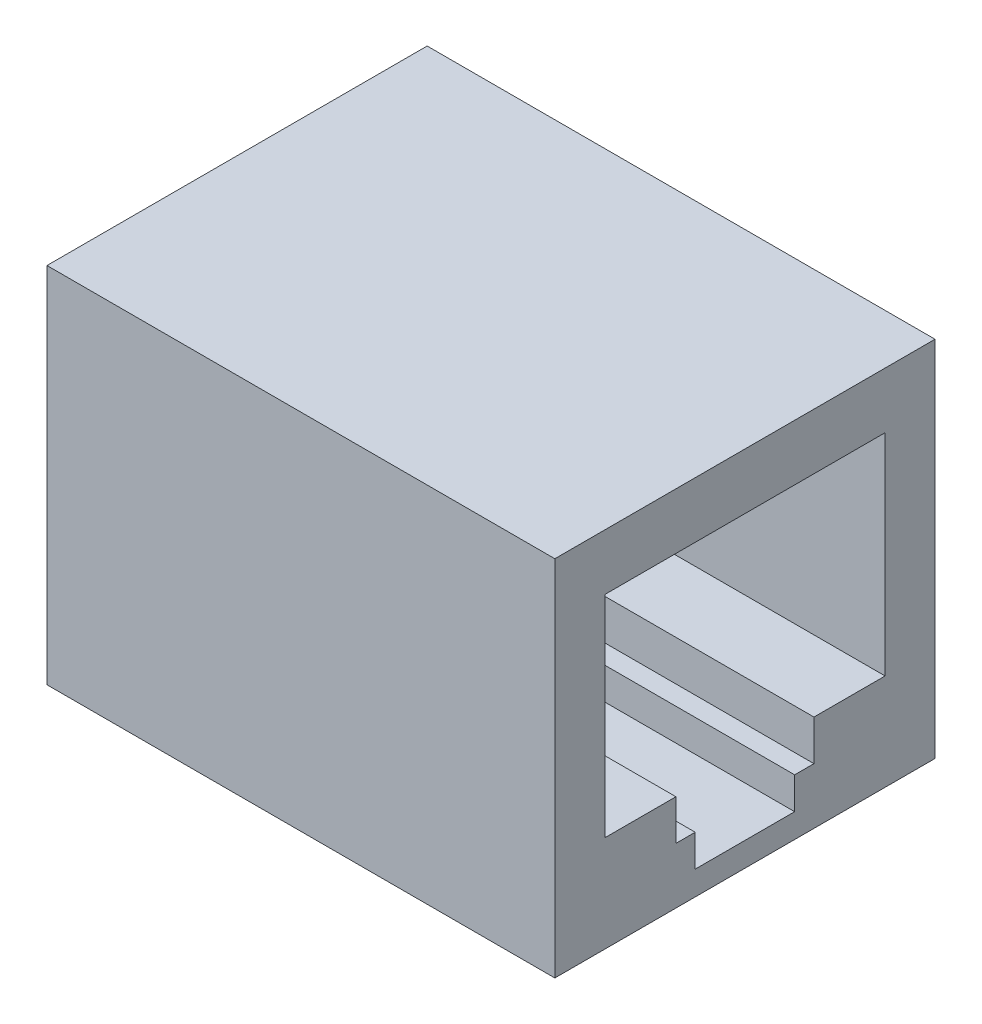
ISO-10303-21;
HEADER;
FILE_DESCRIPTION(('STEP AP214'),'2;1');
FILE_NAME('part.step','',(''),(''),'','','');
FILE_SCHEMA(('AUTOMOTIVE_DESIGN { 1 0 10303 214 1 1 1 1 }'));
ENDSEC;
DATA;
#1=APPLICATION_CONTEXT('core data for automotive mechanical design processes');
#2=APPLICATION_PROTOCOL_DEFINITION('international standard','automotive_design',2000,#1);
#3=PRODUCT_CONTEXT('',#1,'mechanical');
#4=PRODUCT('Part','Part','',(#3));
#5=PRODUCT_RELATED_PRODUCT_CATEGORY('part','',(#4));
#6=PRODUCT_DEFINITION_FORMATION('','',#4);
#7=PRODUCT_DEFINITION_CONTEXT('part definition',#1,'design');
#8=PRODUCT_DEFINITION('design','',#6,#7);
#9=PRODUCT_DEFINITION_SHAPE('','',#8);
#10=(LENGTH_UNIT() NAMED_UNIT(*) SI_UNIT(.MILLI.,.METRE.));
#11=(NAMED_UNIT(*) PLANE_ANGLE_UNIT() SI_UNIT($,.RADIAN.));
#12=(NAMED_UNIT(*) SI_UNIT($,.STERADIAN.) SOLID_ANGLE_UNIT());
#13=UNCERTAINTY_MEASURE_WITH_UNIT(LENGTH_MEASURE(1.E-05),#10,'distance_accuracy_value','');
#14=(GEOMETRIC_REPRESENTATION_CONTEXT(3) GLOBAL_UNCERTAINTY_ASSIGNED_CONTEXT((#13)) GLOBAL_UNIT_ASSIGNED_CONTEXT((#10,
#11,#12)) REPRESENTATION_CONTEXT('',''));
#15=CARTESIAN_POINT('',(0.,0.,0.));
#16=DIRECTION('',(0.,0.,1.));
#17=DIRECTION('',(1.,0.,0.));
#18=AXIS2_PLACEMENT_3D('',#15,#16,#17);
#19=CARTESIAN_POINT('',(54.428765489023,-5.08779999900248,21.8945000000485));
#20=DIRECTION('',(0.,1.,0.));
#21=DIRECTION('',(1.,0.,0.));
#22=AXIS2_PLACEMENT_3D('',#19,#20,#21);
#23=PLANE('',#22);
#24=DIRECTION('',(0.,0.,-1.));
#25=VECTOR('',#24,1.);
#26=CARTESIAN_POINT('',(34.1938264547354,-5.08779999900248,21.8945000000485));
#27=LINE('',#26,#25);
#28=CARTESIAN_POINT('',(34.1938264547354,-5.08779999900248,21.8945000000485));
#29=VERTEX_POINT('',#28);
#30=CARTESIAN_POINT('',(34.1938264547354,-5.08779999900249,21.0817000000485));
#31=VERTEX_POINT('',#30);
#32=EDGE_CURVE('E41',#29,#31,#27,.T.);
#33=ORIENTED_EDGE('',*,*,#32,.F.);
#34=DIRECTION('',(1.,0.,0.));
#35=VECTOR('',#34,1.);
#36=CARTESIAN_POINT('',(34.1938264547354,-5.08779999900248,21.8945000000485));
#37=LINE('',#36,#35);
#38=CARTESIAN_POINT('',(46.3938264547354,-5.08779999900248,21.8945000000485));
#39=VERTEX_POINT('',#38);
#40=EDGE_CURVE('E11',#29,#39,#37,.T.);
#41=ORIENTED_EDGE('',*,*,#40,.T.);
#42=DIRECTION('',(0.,0.,-1.));
#43=VECTOR('',#42,1.);
#44=CARTESIAN_POINT('',(46.3938264547354,-5.08779999900248,21.8945000000485));
#45=LINE('',#44,#43);
#46=CARTESIAN_POINT('',(46.3938264547354,-5.08779999900249,21.0817000000485));
#47=VERTEX_POINT('',#46);
#48=EDGE_CURVE('E28',#39,#47,#45,.T.);
#49=ORIENTED_EDGE('',*,*,#48,.T.);
#50=DIRECTION('',(1.,0.,0.));
#51=VECTOR('',#50,1.);
#52=CARTESIAN_POINT('',(34.1938264547354,-5.08779999900249,21.0817000000485));
#53=LINE('',#52,#51);
#54=EDGE_CURVE('E247',#31,#47,#53,.T.);
#55=ORIENTED_EDGE('',*,*,#54,.F.);
#56=EDGE_LOOP('',(#33,#41,#49,#55));
#57=FACE_BOUND('',#56,.T.);
#58=ADVANCED_FACE('F17',(#57),#23,.T.);
#59=CARTESIAN_POINT('',(34.1938264547354,-20.6051200114452,23.9900000000484));
#60=DIRECTION('',(1.,0.,0.));
#61=DIRECTION('',(0.,1.,0.));
#62=AXIS2_PLACEMENT_3D('',#59,#60,#61);
#63=PLANE('',#62);
#64=ORIENTED_EDGE('',*,*,#32,.T.);
#65=DIRECTION('',(0.,1.,0.));
#66=VECTOR('',#65,1.);
#67=CARTESIAN_POINT('',(34.1938264547354,-5.08779999900249,21.0817000000485));
#68=LINE('',#67,#66);
#69=CARTESIAN_POINT('',(34.1938264547354,-3.38599999900249,21.0817000000485));
#70=VERTEX_POINT('',#69);
#71=EDGE_CURVE('E261',#31,#70,#68,.T.);
#72=ORIENTED_EDGE('',*,*,#71,.T.);
#73=DIRECTION('',(0.,0.,-1.));
#74=VECTOR('',#73,1.);
#75=CARTESIAN_POINT('',(34.1938264547354,-3.38599999900249,21.0817000000485));
#76=LINE('',#75,#74);
#77=CARTESIAN_POINT('',(34.1938264547354,-3.38599999900248,18.0845000000485));
#78=VERTEX_POINT('',#77);
#79=EDGE_CURVE('E211',#70,#78,#76,.T.);
#80=ORIENTED_EDGE('',*,*,#79,.T.);
#81=DIRECTION('',(0.,1.,0.));
#82=VECTOR('',#81,1.);
#83=CARTESIAN_POINT('',(34.1938264547354,-3.38599999900248,18.0845000000485));
#84=LINE('',#83,#82);
#85=CARTESIAN_POINT('',(34.1938264547354,5.49111945001675,18.0845000000485));
#86=VERTEX_POINT('',#85);
#87=EDGE_CURVE('E182',#78,#86,#84,.T.);
#88=ORIENTED_EDGE('',*,*,#87,.T.);
#89=DIRECTION('',(0.,0.,1.));
#90=VECTOR('',#89,1.);
#91=CARTESIAN_POINT('',(34.1938264547354,5.49111945001675,18.0845000000485));
#92=LINE('',#91,#90);
#93=CARTESIAN_POINT('',(34.1938264547354,5.49111945001675,29.8955000000484));
#94=VERTEX_POINT('',#93);
#95=EDGE_CURVE('E176',#86,#94,#92,.T.);
#96=ORIENTED_EDGE('',*,*,#95,.T.);
#97=DIRECTION('',(0.,-1.,0.));
#98=VECTOR('',#97,1.);
#99=CARTESIAN_POINT('',(34.1938264547354,5.49111945001675,29.8955000000484));
#100=LINE('',#99,#98);
#101=CARTESIAN_POINT('',(34.1938264547354,-3.38599999900248,29.8955000000485));
#102=VERTEX_POINT('',#101);
#103=EDGE_CURVE('E166',#94,#102,#100,.T.);
#104=ORIENTED_EDGE('',*,*,#103,.T.);
#105=DIRECTION('',(0.,0.,-1.));
#106=VECTOR('',#105,1.);
#107=CARTESIAN_POINT('',(34.1938264547354,-3.38599999900248,29.8955000000485));
#108=LINE('',#107,#106);
#109=CARTESIAN_POINT('',(34.1938264547354,-3.38599999900248,26.8983000000485));
#110=VERTEX_POINT('',#109);
#111=EDGE_CURVE('E158',#102,#110,#108,.T.);
#112=ORIENTED_EDGE('',*,*,#111,.T.);
#113=DIRECTION('',(0.,-1.,0.));
#114=VECTOR('',#113,1.);
#115=CARTESIAN_POINT('',(34.1938264547354,-3.38599999900248,26.8983000000485));
#116=LINE('',#115,#114);
#117=CARTESIAN_POINT('',(34.1938264547354,-5.08779999900248,26.8983000000485));
#118=VERTEX_POINT('',#117);
#119=EDGE_CURVE('E208',#110,#118,#116,.T.);
#120=ORIENTED_EDGE('',*,*,#119,.T.);
#121=DIRECTION('',(0.,0.,-1.));
#122=VECTOR('',#121,1.);
#123=CARTESIAN_POINT('',(34.1938264547354,-5.08779999900248,26.8983000000485));
#124=LINE('',#123,#122);
#125=CARTESIAN_POINT('',(34.1938264547354,-5.08779999900248,26.0855000000485));
#126=VERTEX_POINT('',#125);
#127=EDGE_CURVE('E259',#118,#126,#124,.T.);
#128=ORIENTED_EDGE('',*,*,#127,.T.);
#129=DIRECTION('',(0.,-1.,0.));
#130=VECTOR('',#129,1.);
#131=CARTESIAN_POINT('',(34.1938264547354,-5.08779999900248,26.0855000000485));
#132=LINE('',#131,#130);
#133=CARTESIAN_POINT('',(34.1938264547354,-6.43399999900248,26.0855000000484));
#134=VERTEX_POINT('',#133);
#135=EDGE_CURVE('E294',#126,#134,#132,.T.);
#136=ORIENTED_EDGE('',*,*,#135,.T.);
#137=DIRECTION('',(0.,0.,-1.));
#138=VECTOR('',#137,1.);
#139=CARTESIAN_POINT('',(34.1938264547354,-6.43399999900248,26.0855000000484));
#140=LINE('',#139,#138);
#141=CARTESIAN_POINT('',(34.1938264547354,-6.43399999900249,21.8945000000484));
#142=VERTEX_POINT('',#141);
#143=EDGE_CURVE('E290',#134,#142,#140,.T.);
#144=ORIENTED_EDGE('',*,*,#143,.T.);
#145=DIRECTION('',(0.,1.,0.));
#146=VECTOR('',#145,1.);
#147=CARTESIAN_POINT('',(34.1938264547354,-6.43399999900248,21.8945000000484));
#148=LINE('',#147,#146);
#149=EDGE_CURVE('E216',#142,#29,#148,.T.);
#150=ORIENTED_EDGE('',*,*,#149,.T.);
#151=EDGE_LOOP('',(#64,#72,#80,#88,#96,#104,#112,#120,#128,#136,#144,#150));
#152=FACE_BOUND('',#151,.T.);
#153=ADVANCED_FACE('F179',(#152),#63,.T.);
#154=CARTESIAN_POINT('',(54.428765489023,-6.43399999900248,26.0855000000485));
#155=DIRECTION('',(0.,1.,0.));
#156=DIRECTION('',(1.,0.,0.));
#157=AXIS2_PLACEMENT_3D('',#154,#155,#156);
#158=PLANE('',#157);
#159=ORIENTED_EDGE('',*,*,#143,.F.);
#160=DIRECTION('',(1.,0.,0.));
#161=VECTOR('',#160,1.);
#162=CARTESIAN_POINT('',(34.1938264547354,-6.43399999900248,26.0855000000484));
#163=LINE('',#162,#161);
#164=CARTESIAN_POINT('',(46.3938264547354,-6.43399999900248,26.0855000000484));
#165=VERTEX_POINT('',#164);
#166=EDGE_CURVE('E212',#134,#165,#163,.T.);
#167=ORIENTED_EDGE('',*,*,#166,.T.);
#168=DIRECTION('',(0.,0.,-1.));
#169=VECTOR('',#168,1.);
#170=CARTESIAN_POINT('',(46.3938264547354,-6.43399999900248,26.0855000000484));
#171=LINE('',#170,#169);
#172=CARTESIAN_POINT('',(46.3938264547354,-6.43399999900249,21.8945000000485));
#173=VERTEX_POINT('',#172);
#174=EDGE_CURVE('E204',#165,#173,#171,.T.);
#175=ORIENTED_EDGE('',*,*,#174,.T.);
#176=DIRECTION('',(1.,0.,0.));
#177=VECTOR('',#176,1.);
#178=CARTESIAN_POINT('',(34.1938264547354,-6.43399999900248,21.8945000000484));
#179=LINE('',#178,#177);
#180=EDGE_CURVE('E298',#142,#173,#179,.T.);
#181=ORIENTED_EDGE('',*,*,#180,.F.);
#182=EDGE_LOOP('',(#159,#167,#175,#181));
#183=FACE_BOUND('',#182,.T.);
#184=ADVANCED_FACE('F495',(#183),#158,.T.);
#185=CARTESIAN_POINT('',(54.428765489023,-5.08779999900248,26.0855000000485));
#186=DIRECTION('',(0.,0.,-1.));
#187=DIRECTION('',(-1.,0.,0.));
#188=AXIS2_PLACEMENT_3D('',#185,#186,#187);
#189=PLANE('',#188);
#190=ORIENTED_EDGE('',*,*,#135,.F.);
#191=DIRECTION('',(1.,0.,0.));
#192=VECTOR('',#191,1.);
#193=CARTESIAN_POINT('',(34.1938264547354,-5.08779999900248,26.0855000000485));
#194=LINE('',#193,#192);
#195=CARTESIAN_POINT('',(46.3938264547354,-5.08779999900248,26.0855000000485));
#196=VERTEX_POINT('',#195);
#197=EDGE_CURVE('E221',#126,#196,#194,.T.);
#198=ORIENTED_EDGE('',*,*,#197,.T.);
#199=DIRECTION('',(0.,-1.,0.));
#200=VECTOR('',#199,1.);
#201=CARTESIAN_POINT('',(46.3938264547354,-5.08779999900248,26.0855000000485));
#202=LINE('',#201,#200);
#203=EDGE_CURVE('E217',#196,#165,#202,.T.);
#204=ORIENTED_EDGE('',*,*,#203,.T.);
#205=ORIENTED_EDGE('',*,*,#166,.F.);
#206=EDGE_LOOP('',(#190,#198,#204,#205));
#207=FACE_BOUND('',#206,.T.);
#208=ADVANCED_FACE('F489',(#207),#189,.T.);
#209=CARTESIAN_POINT('',(54.428765489023,-5.08779999900248,26.8983000000485));
#210=DIRECTION('',(0.,1.,0.));
#211=DIRECTION('',(1.,0.,0.));
#212=AXIS2_PLACEMENT_3D('',#209,#210,#211);
#213=PLANE('',#212);
#214=ORIENTED_EDGE('',*,*,#127,.F.);
#215=DIRECTION('',(1.,0.,0.));
#216=VECTOR('',#215,1.);
#217=CARTESIAN_POINT('',(34.1938264547354,-5.08779999900248,26.8983000000485));
#218=LINE('',#217,#216);
#219=CARTESIAN_POINT('',(46.3938264547354,-5.08779999900248,26.8983000000485));
#220=VERTEX_POINT('',#219);
#221=EDGE_CURVE('E222',#118,#220,#218,.T.);
#222=ORIENTED_EDGE('',*,*,#221,.T.);
#223=DIRECTION('',(0.,0.,-1.));
#224=VECTOR('',#223,1.);
#225=CARTESIAN_POINT('',(46.3938264547354,-5.08779999900248,26.8983000000485));
#226=LINE('',#225,#224);
#227=EDGE_CURVE('E223',#220,#196,#226,.T.);
#228=ORIENTED_EDGE('',*,*,#227,.T.);
#229=ORIENTED_EDGE('',*,*,#197,.F.);
#230=EDGE_LOOP('',(#214,#222,#228,#229));
#231=FACE_BOUND('',#230,.T.);
#232=ADVANCED_FACE('F494',(#231),#213,.T.);
#233=CARTESIAN_POINT('',(54.428765489023,-3.38599999900248,26.8983000000485));
#234=DIRECTION('',(0.,0.,-1.));
#235=DIRECTION('',(0.,-1.,0.));
#236=AXIS2_PLACEMENT_3D('',#233,#234,#235);
#237=PLANE('',#236);
#238=ORIENTED_EDGE('',*,*,#119,.F.);
#239=DIRECTION('',(1.,0.,0.));
#240=VECTOR('',#239,1.);
#241=CARTESIAN_POINT('',(34.1938264547354,-3.38599999900248,26.8983000000485));
#242=LINE('',#241,#240);
#243=CARTESIAN_POINT('',(46.3938264547354,-3.38599999900248,26.8983000000485));
#244=VERTEX_POINT('',#243);
#245=EDGE_CURVE('E227',#110,#244,#242,.T.);
#246=ORIENTED_EDGE('',*,*,#245,.T.);
#247=DIRECTION('',(0.,-1.,0.));
#248=VECTOR('',#247,1.);
#249=CARTESIAN_POINT('',(46.3938264547354,-3.38599999900248,26.8983000000485));
#250=LINE('',#249,#248);
#251=EDGE_CURVE('E253',#244,#220,#250,.T.);
#252=ORIENTED_EDGE('',*,*,#251,.T.);
#253=ORIENTED_EDGE('',*,*,#221,.F.);
#254=EDGE_LOOP('',(#238,#246,#252,#253));
#255=FACE_BOUND('',#254,.T.);
#256=ADVANCED_FACE('F19',(#255),#237,.T.);
#257=CARTESIAN_POINT('',(54.428765489023,-3.38599999900248,29.8955000000485));
#258=DIRECTION('',(0.,1.,0.));
#259=DIRECTION('',(1.,0.,0.));
#260=AXIS2_PLACEMENT_3D('',#257,#258,#259);
#261=PLANE('',#260);
#262=ORIENTED_EDGE('',*,*,#111,.F.);
#263=DIRECTION('',(1.,0.,0.));
#264=VECTOR('',#263,1.);
#265=CARTESIAN_POINT('',(34.1938264547354,-3.38599999900248,29.8955000000485));
#266=LINE('',#265,#264);
#267=CARTESIAN_POINT('',(46.3938264547354,-3.38599999900248,29.8955000000485));
#268=VERTEX_POINT('',#267);
#269=EDGE_CURVE('E173',#102,#268,#266,.T.);
#270=ORIENTED_EDGE('',*,*,#269,.T.);
#271=DIRECTION('',(0.,0.,-1.));
#272=VECTOR('',#271,1.);
#273=CARTESIAN_POINT('',(46.3938264547354,-3.38599999900248,29.8955000000485));
#274=LINE('',#273,#272);
#275=EDGE_CURVE('E190',#268,#244,#274,.T.);
#276=ORIENTED_EDGE('',*,*,#275,.T.);
#277=ORIENTED_EDGE('',*,*,#245,.F.);
#278=EDGE_LOOP('',(#262,#270,#276,#277));
#279=FACE_BOUND('',#278,.T.);
#280=ADVANCED_FACE('F459',(#279),#261,.T.);
#281=CARTESIAN_POINT('',(54.428765489023,5.49111945001675,29.8955000000485));
#282=DIRECTION('',(0.,0.,-1.));
#283=DIRECTION('',(0.,-1.,0.));
#284=AXIS2_PLACEMENT_3D('',#281,#282,#283);
#285=PLANE('',#284);
#286=ORIENTED_EDGE('',*,*,#103,.F.);
#287=DIRECTION('',(1.,0.,0.));
#288=VECTOR('',#287,1.);
#289=CARTESIAN_POINT('',(34.1938264547354,5.49111945001675,29.8955000000484));
#290=LINE('',#289,#288);
#291=CARTESIAN_POINT('',(46.3938264547355,5.49111945001675,29.8955000000484));
#292=VERTEX_POINT('',#291);
#293=EDGE_CURVE('E171',#94,#292,#290,.T.);
#294=ORIENTED_EDGE('',*,*,#293,.T.);
#295=DIRECTION('',(0.,-1.,0.));
#296=VECTOR('',#295,1.);
#297=CARTESIAN_POINT('',(46.3938264547354,5.49111945001675,29.8955000000484));
#298=LINE('',#297,#296);
#299=EDGE_CURVE('E191',#292,#268,#298,.T.);
#300=ORIENTED_EDGE('',*,*,#299,.T.);
#301=ORIENTED_EDGE('',*,*,#269,.F.);
#302=EDGE_LOOP('',(#286,#294,#300,#301));
#303=FACE_BOUND('',#302,.T.);
#304=ADVANCED_FACE('F168',(#303),#285,.T.);
#305=CARTESIAN_POINT('',(54.428765489023,5.49111945001675,18.0845000000485));
#306=DIRECTION('',(0.,-1.,0.));
#307=DIRECTION('',(0.,0.,-1.));
#308=AXIS2_PLACEMENT_3D('',#305,#306,#307);
#309=PLANE('',#308);
#310=ORIENTED_EDGE('',*,*,#95,.F.);
#311=DIRECTION('',(1.,0.,0.));
#312=VECTOR('',#311,1.);
#313=CARTESIAN_POINT('',(34.1938264547354,5.49111945001675,18.0845000000485));
#314=LINE('',#313,#312);
#315=CARTESIAN_POINT('',(46.3938264547354,5.49111945001675,18.0845000000485));
#316=VERTEX_POINT('',#315);
#317=EDGE_CURVE('E200',#86,#316,#314,.T.);
#318=ORIENTED_EDGE('',*,*,#317,.T.);
#319=DIRECTION('',(0.,0.,1.));
#320=VECTOR('',#319,1.);
#321=CARTESIAN_POINT('',(46.3938264547355,5.49111945001675,18.0845000000485));
#322=LINE('',#321,#320);
#323=EDGE_CURVE('E188',#316,#292,#322,.T.);
#324=ORIENTED_EDGE('',*,*,#323,.T.);
#325=ORIENTED_EDGE('',*,*,#293,.F.);
#326=EDGE_LOOP('',(#310,#318,#324,#325));
#327=FACE_BOUND('',#326,.T.);
#328=ADVANCED_FACE('F187',(#327),#309,.T.);
#329=CARTESIAN_POINT('',(54.428765489023,-3.38599999900249,18.0845000000485));
#330=DIRECTION('',(0.,0.,1.));
#331=DIRECTION('',(1.,0.,0.));
#332=AXIS2_PLACEMENT_3D('',#329,#330,#331);
#333=PLANE('',#332);
#334=ORIENTED_EDGE('',*,*,#87,.F.);
#335=DIRECTION('',(1.,0.,0.));
#336=VECTOR('',#335,1.);
#337=CARTESIAN_POINT('',(34.1938264547354,-3.38599999900249,18.0845000000485));
#338=LINE('',#337,#336);
#339=CARTESIAN_POINT('',(46.3938264547354,-3.38599999900248,18.0845000000485));
#340=VERTEX_POINT('',#339);
#341=EDGE_CURVE('E228',#78,#340,#338,.T.);
#342=ORIENTED_EDGE('',*,*,#341,.T.);
#343=DIRECTION('',(0.,1.,0.));
#344=VECTOR('',#343,1.);
#345=CARTESIAN_POINT('',(46.3938264547354,-3.38599999900249,18.0845000000485));
#346=LINE('',#345,#344);
#347=EDGE_CURVE('E232',#340,#316,#346,.T.);
#348=ORIENTED_EDGE('',*,*,#347,.T.);
#349=ORIENTED_EDGE('',*,*,#317,.F.);
#350=EDGE_LOOP('',(#334,#342,#348,#349));
#351=FACE_BOUND('',#350,.T.);
#352=ADVANCED_FACE('F354',(#351),#333,.T.);
#353=CARTESIAN_POINT('',(54.428765489023,-3.38599999900249,21.0817000000485));
#354=DIRECTION('',(0.,1.,0.));
#355=DIRECTION('',(1.,0.,0.));
#356=AXIS2_PLACEMENT_3D('',#353,#354,#355);
#357=PLANE('',#356);
#358=ORIENTED_EDGE('',*,*,#79,.F.);
#359=DIRECTION('',(1.,0.,0.));
#360=VECTOR('',#359,1.);
#361=CARTESIAN_POINT('',(34.1938264547354,-3.38599999900249,21.0817000000485));
#362=LINE('',#361,#360);
#363=CARTESIAN_POINT('',(46.3938264547354,-3.38599999900249,21.0817000000485));
#364=VERTEX_POINT('',#363);
#365=EDGE_CURVE('E252',#70,#364,#362,.T.);
#366=ORIENTED_EDGE('',*,*,#365,.T.);
#367=DIRECTION('',(0.,0.,-1.));
#368=VECTOR('',#367,1.);
#369=CARTESIAN_POINT('',(46.3938264547354,-3.38599999900249,21.0817000000485));
#370=LINE('',#369,#368);
#371=EDGE_CURVE('E248',#364,#340,#370,.T.);
#372=ORIENTED_EDGE('',*,*,#371,.T.);
#373=ORIENTED_EDGE('',*,*,#341,.F.);
#374=EDGE_LOOP('',(#358,#366,#372,#373));
#375=FACE_BOUND('',#374,.T.);
#376=ADVANCED_FACE('F351',(#375),#357,.T.);
#377=CARTESIAN_POINT('',(54.428765489023,-5.08779999900249,21.0817000000485));
#378=DIRECTION('',(0.,0.,1.));
#379=DIRECTION('',(1.,0.,0.));
#380=AXIS2_PLACEMENT_3D('',#377,#378,#379);
#381=PLANE('',#380);
#382=ORIENTED_EDGE('',*,*,#71,.F.);
#383=ORIENTED_EDGE('',*,*,#54,.T.);
#384=DIRECTION('',(0.,1.,0.));
#385=VECTOR('',#384,1.);
#386=CARTESIAN_POINT('',(46.3938264547354,-5.08779999900249,21.0817000000485));
#387=LINE('',#386,#385);
#388=EDGE_CURVE('E242',#47,#364,#387,.T.);
#389=ORIENTED_EDGE('',*,*,#388,.T.);
#390=ORIENTED_EDGE('',*,*,#365,.F.);
#391=EDGE_LOOP('',(#382,#383,#389,#390));
#392=FACE_BOUND('',#391,.T.);
#393=ADVANCED_FACE('F445',(#392),#381,.T.);
#394=CARTESIAN_POINT('',(46.3938264547354,-7.44999999998325,23.9900000000485));
#395=DIRECTION('',(1.,0.,0.));
#396=DIRECTION('',(0.,1.,0.));
#397=AXIS2_PLACEMENT_3D('',#394,#395,#396);
#398=PLANE('',#397);
#399=DIRECTION('',(0.,0.,-1.));
#400=VECTOR('',#399,1.);
#401=CARTESIAN_POINT('',(46.3938264547354,7.85000000099751,32.0000000000484));
#402=LINE('',#401,#400);
#403=CARTESIAN_POINT('',(46.3938264547354,7.85000000099751,32.0000000000484));
#404=VERTEX_POINT('',#403);
#405=CARTESIAN_POINT('',(46.3938264547354,7.85000000099751,15.9800000000485));
#406=VERTEX_POINT('',#405);
#407=EDGE_CURVE('E233',#404,#406,#402,.T.);
#408=ORIENTED_EDGE('',*,*,#407,.F.);
#409=DIRECTION('',(0.,1.,0.));
#410=VECTOR('',#409,1.);
#411=CARTESIAN_POINT('',(46.3938264547354,-7.44999999998325,32.0000000000484));
#412=LINE('',#411,#410);
#413=CARTESIAN_POINT('',(46.3938264547354,-7.44999999998325,32.0000000000484));
#414=VERTEX_POINT('',#413);
#415=EDGE_CURVE('E316',#414,#404,#412,.T.);
#416=ORIENTED_EDGE('',*,*,#415,.F.);
#417=DIRECTION('',(0.,0.,-1.));
#418=VECTOR('',#417,1.);
#419=CARTESIAN_POINT('',(46.3938264547354,-7.44999999998325,32.0000000000484));
#420=LINE('',#419,#418);
#421=CARTESIAN_POINT('',(46.3938264547354,-7.44999999998325,15.9800000000485));
#422=VERTEX_POINT('',#421);
#423=EDGE_CURVE('E238',#414,#422,#420,.T.);
#424=ORIENTED_EDGE('',*,*,#423,.T.);
#425=DIRECTION('',(0.,1.,0.));
#426=VECTOR('',#425,1.);
#427=CARTESIAN_POINT('',(46.3938264547354,-7.44999999998325,15.9800000000485));
#428=LINE('',#427,#426);
#429=EDGE_CURVE('E243',#422,#406,#428,.T.);
#430=ORIENTED_EDGE('',*,*,#429,.T.);
#431=EDGE_LOOP('',(#408,#416,#424,#430));
#432=FACE_BOUND('',#431,.T.);
#433=ORIENTED_EDGE('',*,*,#251,.F.);
#434=ORIENTED_EDGE('',*,*,#275,.F.);
#435=ORIENTED_EDGE('',*,*,#299,.F.);
#436=ORIENTED_EDGE('',*,*,#323,.F.);
#437=ORIENTED_EDGE('',*,*,#347,.F.);
#438=ORIENTED_EDGE('',*,*,#371,.F.);
#439=ORIENTED_EDGE('',*,*,#388,.F.);
#440=ORIENTED_EDGE('',*,*,#48,.F.);
#441=DIRECTION('',(0.,1.,0.));
#442=VECTOR('',#441,1.);
#443=CARTESIAN_POINT('',(46.3938264547354,-6.43399999900248,21.8945000000485));
#444=LINE('',#443,#442);
#445=EDGE_CURVE('E301',#173,#39,#444,.T.);
#446=ORIENTED_EDGE('',*,*,#445,.F.);
#447=ORIENTED_EDGE('',*,*,#174,.F.);
#448=ORIENTED_EDGE('',*,*,#203,.F.);
#449=ORIENTED_EDGE('',*,*,#227,.F.);
#450=EDGE_LOOP('',(#433,#434,#435,#436,#437,#438,#439,#440,#446,#447,#448,#449));
#451=FACE_BOUND('',#450,.T.);
#452=ADVANCED_FACE('F358',(#432,#451),#398,.T.);
#453=CARTESIAN_POINT('',(24.9938264547353,-7.44999999998325,23.9900000000485));
#454=DIRECTION('',(0.,-1.,0.));
#455=DIRECTION('',(0.,0.,-1.));
#456=AXIS2_PLACEMENT_3D('',#453,#454,#455);
#457=PLANE('',#456);
#458=DIRECTION('',(1.,0.,0.));
#459=VECTOR('',#458,1.);
#460=CARTESIAN_POINT('',(24.9938264547353,-7.44999999998325,15.9800000000485));
#461=LINE('',#460,#459);
#462=CARTESIAN_POINT('',(24.9938264547353,-7.44999999998325,15.9800000000485));
#463=VERTEX_POINT('',#462);
#464=EDGE_CURVE('E267',#463,#422,#461,.T.);
#465=ORIENTED_EDGE('',*,*,#464,.T.);
#466=ORIENTED_EDGE('',*,*,#423,.F.);
#467=DIRECTION('',(1.,0.,0.));
#468=VECTOR('',#467,1.);
#469=CARTESIAN_POINT('',(24.9938264547353,-7.44999999998325,32.0000000000484));
#470=LINE('',#469,#468);
#471=CARTESIAN_POINT('',(24.9938264547353,-7.44999999998325,32.0000000000484));
#472=VERTEX_POINT('',#471);
#473=EDGE_CURVE('E320',#472,#414,#470,.T.);
#474=ORIENTED_EDGE('',*,*,#473,.F.);
#475=DIRECTION('',(0.,0.,-1.));
#476=VECTOR('',#475,1.);
#477=CARTESIAN_POINT('',(24.9938264547353,-7.44999999998325,32.0000000000484));
#478=LINE('',#477,#476);
#479=EDGE_CURVE('E274',#472,#463,#478,.T.);
#480=ORIENTED_EDGE('',*,*,#479,.T.);
#481=EDGE_LOOP('',(#465,#466,#474,#480));
#482=FACE_BOUND('',#481,.T.);
#483=ADVANCED_FACE('F518',(#482),#457,.T.);
#484=CARTESIAN_POINT('',(24.9938264547353,0.20000000050713,32.0000000000484));
#485=DIRECTION('',(-1.,0.,0.));
#486=DIRECTION('',(0.,0.,1.));
#487=AXIS2_PLACEMENT_3D('',#484,#485,#486);
#488=PLANE('',#487);
#489=DIRECTION('',(0.,0.,-1.));
#490=VECTOR('',#489,1.);
#491=CARTESIAN_POINT('',(24.9938264547353,7.85000000099751,32.0000000000484));
#492=LINE('',#491,#490);
#493=CARTESIAN_POINT('',(24.9938264547353,7.85000000099751,32.0000000000484));
#494=VERTEX_POINT('',#493);
#495=CARTESIAN_POINT('',(24.9938264547353,7.85000000099751,15.9800000000485));
#496=VERTEX_POINT('',#495);
#497=EDGE_CURVE('E21',#494,#496,#492,.T.);
#498=ORIENTED_EDGE('',*,*,#497,.T.);
#499=DIRECTION('',(0.,1.,0.));
#500=VECTOR('',#499,1.);
#501=CARTESIAN_POINT('',(24.9938264547353,-7.44999999998325,15.9800000000485));
#502=LINE('',#501,#500);
#503=EDGE_CURVE('E289',#463,#496,#502,.T.);
#504=ORIENTED_EDGE('',*,*,#503,.F.);
#505=ORIENTED_EDGE('',*,*,#479,.F.);
#506=DIRECTION('',(0.,1.,0.));
#507=VECTOR('',#506,1.);
#508=CARTESIAN_POINT('',(24.9938264547353,-7.44999999998325,32.0000000000484));
#509=LINE('',#508,#507);
#510=EDGE_CURVE('E321',#472,#494,#509,.T.);
#511=ORIENTED_EDGE('',*,*,#510,.T.);
#512=EDGE_LOOP('',(#498,#504,#505,#511));
#513=FACE_BOUND('',#512,.T.);
#514=ADVANCED_FACE('F474',(#513),#488,.T.);
#515=CARTESIAN_POINT('',(35.6938264547354,-7.44999999998325,32.0000000000484));
#516=DIRECTION('',(0.,0.,1.));
#517=DIRECTION('',(1.,0.,0.));
#518=AXIS2_PLACEMENT_3D('',#515,#516,#517);
#519=PLANE('',#518);
#520=DIRECTION('',(1.,0.,0.));
#521=VECTOR('',#520,1.);
#522=CARTESIAN_POINT('',(24.9938264547353,7.85000000099751,32.0000000000484));
#523=LINE('',#522,#521);
#524=EDGE_CURVE('E236',#494,#404,#523,.T.);
#525=ORIENTED_EDGE('',*,*,#524,.F.);
#526=ORIENTED_EDGE('',*,*,#510,.F.);
#527=ORIENTED_EDGE('',*,*,#473,.T.);
#528=ORIENTED_EDGE('',*,*,#415,.T.);
#529=EDGE_LOOP('',(#525,#526,#527,#528));
#530=FACE_BOUND('',#529,.T.);
#531=ADVANCED_FACE('F468',(#530),#519,.T.);
#532=CARTESIAN_POINT('',(35.6938264547354,7.85000000099751,32.0000000000484));
#533=DIRECTION('',(0.,1.,0.));
#534=DIRECTION('',(1.,0.,0.));
#535=AXIS2_PLACEMENT_3D('',#532,#533,#534);
#536=PLANE('',#535);
#537=DIRECTION('',(1.,0.,0.));
#538=VECTOR('',#537,1.);
#539=CARTESIAN_POINT('',(24.9938264547353,7.85000000099751,15.9800000000485));
#540=LINE('',#539,#538);
#541=EDGE_CURVE('E237',#496,#406,#540,.T.);
#542=ORIENTED_EDGE('',*,*,#541,.F.);
#543=ORIENTED_EDGE('',*,*,#497,.F.);
#544=ORIENTED_EDGE('',*,*,#524,.T.);
#545=ORIENTED_EDGE('',*,*,#407,.T.);
#546=EDGE_LOOP('',(#542,#543,#544,#545));
#547=FACE_BOUND('',#546,.T.);
#548=ADVANCED_FACE('F473',(#547),#536,.T.);
#549=CARTESIAN_POINT('',(24.9938264547353,0.20000000050713,15.9800000000485));
#550=DIRECTION('',(0.,0.,-1.));
#551=DIRECTION('',(0.,-1.,0.));
#552=AXIS2_PLACEMENT_3D('',#549,#550,#551);
#553=PLANE('',#552);
#554=ORIENTED_EDGE('',*,*,#541,.T.);
#555=ORIENTED_EDGE('',*,*,#429,.F.);
#556=ORIENTED_EDGE('',*,*,#464,.F.);
#557=ORIENTED_EDGE('',*,*,#503,.T.);
#558=EDGE_LOOP('',(#554,#555,#556,#557));
#559=FACE_BOUND('',#558,.T.);
#560=ADVANCED_FACE('F530',(#559),#553,.T.);
#561=CARTESIAN_POINT('',(54.428765489023,-6.43399999900248,21.8945000000484));
#562=DIRECTION('',(0.,0.,1.));
#563=DIRECTION('',(1.,0.,0.));
#564=AXIS2_PLACEMENT_3D('',#561,#562,#563);
#565=PLANE('',#564);
#566=ORIENTED_EDGE('',*,*,#149,.F.);
#567=ORIENTED_EDGE('',*,*,#180,.T.);
#568=ORIENTED_EDGE('',*,*,#445,.T.);
#569=ORIENTED_EDGE('',*,*,#40,.F.);
#570=EDGE_LOOP('',(#566,#567,#568,#569));
#571=FACE_BOUND('',#570,.T.);
#572=ADVANCED_FACE('F535',(#571),#565,.T.);
#573=CLOSED_SHELL('',(#58,#153,#184,#208,#232,#256,#280,#304,#328,#352,#376,#393,#452,#483,#514,
#531,#548,#560,#572));
#574=MANIFOLD_SOLID_BREP('B1',#573);
#575=ADVANCED_BREP_SHAPE_REPRESENTATION('',(#18,#574),#14);
#576=SHAPE_DEFINITION_REPRESENTATION(#9,#575);
ENDSEC;
END-ISO-10303-21;
